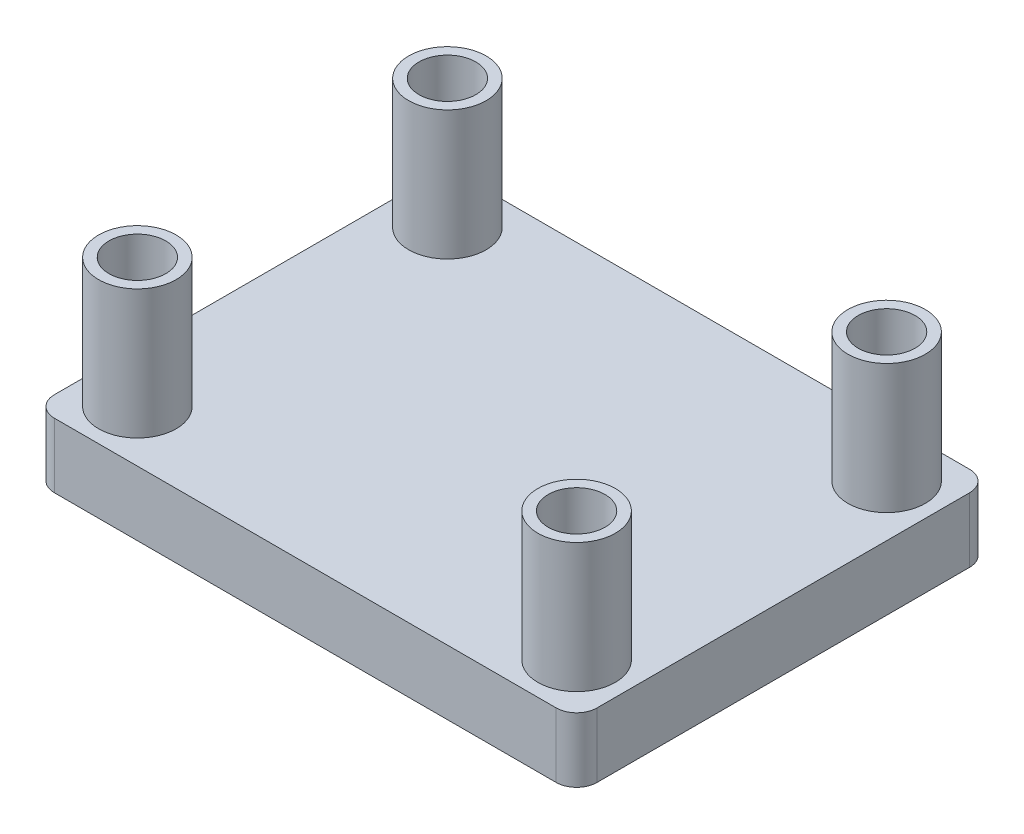
ISO-10303-21;
HEADER;
FILE_DESCRIPTION(('STEP AP214'),'2;1');
FILE_NAME('part.step','',(''),(''),'','','');
FILE_SCHEMA(('AUTOMOTIVE_DESIGN { 1 0 10303 214 1 1 1 1 }'));
ENDSEC;
DATA;
#1=APPLICATION_CONTEXT('core data for automotive mechanical design processes');
#2=APPLICATION_PROTOCOL_DEFINITION('international standard','automotive_design',2000,#1);
#3=PRODUCT_CONTEXT('',#1,'mechanical');
#4=PRODUCT('Part','Part','',(#3));
#5=PRODUCT_RELATED_PRODUCT_CATEGORY('part','',(#4));
#6=PRODUCT_DEFINITION_FORMATION('','',#4);
#7=PRODUCT_DEFINITION_CONTEXT('part definition',#1,'design');
#8=PRODUCT_DEFINITION('design','',#6,#7);
#9=PRODUCT_DEFINITION_SHAPE('','',#8);
#10=(LENGTH_UNIT() NAMED_UNIT(*) SI_UNIT(.MILLI.,.METRE.));
#11=(NAMED_UNIT(*) PLANE_ANGLE_UNIT() SI_UNIT($,.RADIAN.));
#12=(NAMED_UNIT(*) SI_UNIT($,.STERADIAN.) SOLID_ANGLE_UNIT());
#13=UNCERTAINTY_MEASURE_WITH_UNIT(LENGTH_MEASURE(1.E-05),#10,'distance_accuracy_value','');
#14=(GEOMETRIC_REPRESENTATION_CONTEXT(3) GLOBAL_UNCERTAINTY_ASSIGNED_CONTEXT((#13)) GLOBAL_UNIT_ASSIGNED_CONTEXT((#10,
#11,#12)) REPRESENTATION_CONTEXT('',''));
#15=CARTESIAN_POINT('',(0.,0.,0.));
#16=DIRECTION('',(0.,0.,1.));
#17=DIRECTION('',(1.,0.,0.));
#18=AXIS2_PLACEMENT_3D('',#15,#16,#17);
#19=CARTESIAN_POINT('',(-23.7863529411765,3.175,-11.5943529411765));
#20=DIRECTION('',(1.,0.,0.));
#21=DIRECTION('',(0.,0.,-1.));
#22=AXIS2_PLACEMENT_3D('',#19,#20,#21);
#23=PLANE('',#22);
#24=DIRECTION('',(0.,0.,1.));
#25=VECTOR('',#24,1.);
#26=CARTESIAN_POINT('',(-23.7863529411765,3.175,-11.5943529411765));
#27=LINE('',#26,#25);
#28=CARTESIAN_POINT('',(-23.7863529411765,3.175,-10.5943529411765));
#29=VERTEX_POINT('',#28);
#30=CARTESIAN_POINT('',(-23.7863529411765,3.175,7.72564705882353));
#31=VERTEX_POINT('',#30);
#32=EDGE_CURVE('E132',#29,#31,#27,.T.);
#33=ORIENTED_EDGE('',*,*,#32,.F.);
#34=DIRECTION('',(0.,-1.,0.));
#35=VECTOR('',#34,1.);
#36=CARTESIAN_POINT('',(-23.7863529411765,3.175,-10.5943529411765));
#37=LINE('',#36,#35);
#38=CARTESIAN_POINT('',(-23.7863529411765,0.,-10.5943529411765));
#39=VERTEX_POINT('',#38);
#40=EDGE_CURVE('E117',#29,#39,#37,.T.);
#41=ORIENTED_EDGE('',*,*,#40,.T.);
#42=DIRECTION('',(0.,0.,1.));
#43=VECTOR('',#42,1.);
#44=CARTESIAN_POINT('',(-23.7863529411765,0.,-11.5943529411765));
#45=LINE('',#44,#43);
#46=CARTESIAN_POINT('',(-23.7863529411765,0.,7.72564705882353));
#47=VERTEX_POINT('',#46);
#48=EDGE_CURVE('E129',#39,#47,#45,.T.);
#49=ORIENTED_EDGE('',*,*,#48,.T.);
#50=DIRECTION('',(0.,-1.,0.));
#51=VECTOR('',#50,1.);
#52=CARTESIAN_POINT('',(-23.7863529411765,3.175,7.72564705882353));
#53=LINE('',#52,#51);
#54=EDGE_CURVE('E134',#47,#31,#53,.F.);
#55=ORIENTED_EDGE('',*,*,#54,.T.);
#56=EDGE_LOOP('',(#33,#41,#49,#55));
#57=FACE_BOUND('',#56,.T.);
#58=ADVANCED_FACE('F48',(#57),#23,.F.);
#59=CARTESIAN_POINT('',(-23.7863529411765,3.175,8.72564705882353));
#60=DIRECTION('',(0.,0.,-1.));
#61=DIRECTION('',(-1.,0.,0.));
#62=AXIS2_PLACEMENT_3D('',#59,#60,#61);
#63=PLANE('',#62);
#64=DIRECTION('',(1.,0.,0.));
#65=VECTOR('',#64,1.);
#66=CARTESIAN_POINT('',(-23.7863529411765,3.175,8.72564705882353));
#67=LINE('',#66,#65);
#68=CARTESIAN_POINT('',(-22.7863529411765,3.175,8.72564705882353));
#69=VERTEX_POINT('',#68);
#70=CARTESIAN_POINT('',(1.88364705882353,3.175,8.72564705882353));
#71=VERTEX_POINT('',#70);
#72=EDGE_CURVE('E199',#69,#71,#67,.T.);
#73=ORIENTED_EDGE('',*,*,#72,.F.);
#74=DIRECTION('',(0.,-1.,0.));
#75=VECTOR('',#74,1.);
#76=CARTESIAN_POINT('',(-22.7863529411765,3.175,8.72564705882353));
#77=LINE('',#76,#75);
#78=CARTESIAN_POINT('',(-22.7863529411765,0.,8.72564705882353));
#79=VERTEX_POINT('',#78);
#80=EDGE_CURVE('E183',#69,#79,#77,.T.);
#81=ORIENTED_EDGE('',*,*,#80,.T.);
#82=DIRECTION('',(1.,0.,0.));
#83=VECTOR('',#82,1.);
#84=CARTESIAN_POINT('',(-23.7863529411765,0.,8.72564705882353));
#85=LINE('',#84,#83);
#86=CARTESIAN_POINT('',(1.88364705882353,0.,8.72564705882353));
#87=VERTEX_POINT('',#86);
#88=EDGE_CURVE('E138',#79,#87,#85,.T.);
#89=ORIENTED_EDGE('',*,*,#88,.T.);
#90=DIRECTION('',(0.,-1.,0.));
#91=VECTOR('',#90,1.);
#92=CARTESIAN_POINT('',(1.88364705882353,3.175,8.72564705882353));
#93=LINE('',#92,#91);
#94=EDGE_CURVE('E181',#87,#71,#93,.F.);
#95=ORIENTED_EDGE('',*,*,#94,.T.);
#96=EDGE_LOOP('',(#73,#81,#89,#95));
#97=FACE_BOUND('',#96,.T.);
#98=ADVANCED_FACE('F254',(#97),#63,.F.);
#99=CARTESIAN_POINT('',(2.88364705882353,3.175,-11.5943529411765));
#100=DIRECTION('',(-1.,0.,0.));
#101=DIRECTION('',(0.,0.,1.));
#102=AXIS2_PLACEMENT_3D('',#99,#100,#101);
#103=PLANE('',#102);
#104=DIRECTION('',(0.,0.,-1.));
#105=VECTOR('',#104,1.);
#106=CARTESIAN_POINT('',(2.88364705882353,0.,-11.5943529411765));
#107=LINE('',#106,#105);
#108=CARTESIAN_POINT('',(2.88364705882353,0.,7.72564705882353));
#109=VERTEX_POINT('',#108);
#110=CARTESIAN_POINT('',(2.88364705882353,0.,-10.5943529411765));
#111=VERTEX_POINT('',#110);
#112=EDGE_CURVE('E142',#109,#111,#107,.T.);
#113=ORIENTED_EDGE('',*,*,#112,.T.);
#114=DIRECTION('',(0.,-1.,0.));
#115=VECTOR('',#114,1.);
#116=CARTESIAN_POINT('',(2.88364705882353,3.175,-10.5943529411765));
#117=LINE('',#116,#115);
#118=CARTESIAN_POINT('',(2.88364705882353,3.175,-10.5943529411765));
#119=VERTEX_POINT('',#118);
#120=EDGE_CURVE('E12',#111,#119,#117,.F.);
#121=ORIENTED_EDGE('',*,*,#120,.T.);
#122=DIRECTION('',(0.,0.,-1.));
#123=VECTOR('',#122,1.);
#124=CARTESIAN_POINT('',(2.88364705882353,3.175,-11.5943529411765));
#125=LINE('',#124,#123);
#126=CARTESIAN_POINT('',(2.88364705882353,3.175,7.72564705882353));
#127=VERTEX_POINT('',#126);
#128=EDGE_CURVE('E189',#127,#119,#125,.T.);
#129=ORIENTED_EDGE('',*,*,#128,.F.);
#130=DIRECTION('',(0.,-1.,0.));
#131=VECTOR('',#130,1.);
#132=CARTESIAN_POINT('',(2.88364705882353,3.175,7.72564705882353));
#133=LINE('',#132,#131);
#134=EDGE_CURVE('E56',#127,#109,#133,.T.);
#135=ORIENTED_EDGE('',*,*,#134,.T.);
#136=EDGE_LOOP('',(#113,#121,#129,#135));
#137=FACE_BOUND('',#136,.T.);
#138=ADVANCED_FACE('F188',(#137),#103,.F.);
#139=CARTESIAN_POINT('',(-23.7863529411765,3.175,-11.5943529411765));
#140=DIRECTION('',(0.,0.,1.));
#141=DIRECTION('',(1.,0.,0.));
#142=AXIS2_PLACEMENT_3D('',#139,#140,#141);
#143=PLANE('',#142);
#144=DIRECTION('',(-1.,0.,0.));
#145=VECTOR('',#144,1.);
#146=CARTESIAN_POINT('',(-23.7863529411765,0.,-11.5943529411765));
#147=LINE('',#146,#145);
#148=CARTESIAN_POINT('',(1.88364705882352,0.,-11.5943529411765));
#149=VERTEX_POINT('',#148);
#150=CARTESIAN_POINT('',(-22.7863529411765,0.,-11.5943529411765));
#151=VERTEX_POINT('',#150);
#152=EDGE_CURVE('E152',#149,#151,#147,.T.);
#153=ORIENTED_EDGE('',*,*,#152,.T.);
#154=DIRECTION('',(0.,-1.,0.));
#155=VECTOR('',#154,1.);
#156=CARTESIAN_POINT('',(-22.7863529411765,3.175,-11.5943529411765));
#157=LINE('',#156,#155);
#158=CARTESIAN_POINT('',(-22.7863529411765,3.175,-11.5943529411765));
#159=VERTEX_POINT('',#158);
#160=EDGE_CURVE('E118',#151,#159,#157,.F.);
#161=ORIENTED_EDGE('',*,*,#160,.T.);
#162=DIRECTION('',(-1.,0.,0.));
#163=VECTOR('',#162,1.);
#164=CARTESIAN_POINT('',(-23.7863529411765,3.175,-11.5943529411765));
#165=LINE('',#164,#163);
#166=CARTESIAN_POINT('',(1.88364705882352,3.175,-11.5943529411765));
#167=VERTEX_POINT('',#166);
#168=EDGE_CURVE('E148',#167,#159,#165,.T.);
#169=ORIENTED_EDGE('',*,*,#168,.F.);
#170=DIRECTION('',(0.,-1.,0.));
#171=VECTOR('',#170,1.);
#172=CARTESIAN_POINT('',(1.88364705882352,3.175,-11.5943529411765));
#173=LINE('',#172,#171);
#174=EDGE_CURVE('E123',#167,#149,#173,.T.);
#175=ORIENTED_EDGE('',*,*,#174,.T.);
#176=EDGE_LOOP('',(#153,#161,#169,#175));
#177=FACE_BOUND('',#176,.T.);
#178=ADVANCED_FACE('F197',(#177),#143,.F.);
#179=CARTESIAN_POINT('',(0.,3.175,0.));
#180=DIRECTION('',(0.,1.,0.));
#181=DIRECTION('',(0.,0.,1.));
#182=AXIS2_PLACEMENT_3D('',#179,#180,#181);
#183=PLANE('',#182);
#184=CARTESIAN_POINT('',(0.343647058823518,3.175,6.18564705882353));
#185=DIRECTION('',(0.,1.,0.));
#186=DIRECTION('',(0.,0.,1.));
#187=AXIS2_PLACEMENT_3D('',#184,#185,#186);
#188=CIRCLE('',#187,1.905);
#189=CARTESIAN_POINT('',(0.343647058823518,3.175,8.09064705882353));
#190=VERTEX_POINT('',#189);
#191=EDGE_CURVE('E163',#190,#190,#188,.T.);
#192=ORIENTED_EDGE('',*,*,#191,.F.);
#193=EDGE_LOOP('',(#192));
#194=FACE_BOUND('',#193,.T.);
#195=CARTESIAN_POINT('',(-21.2463529411765,3.175,6.18564705882353));
#196=DIRECTION('',(0.,1.,0.));
#197=DIRECTION('',(0.,0.,1.));
#198=AXIS2_PLACEMENT_3D('',#195,#196,#197);
#199=CIRCLE('',#198,1.905);
#200=CARTESIAN_POINT('',(-21.2463529411765,3.175,8.09064705882353));
#201=VERTEX_POINT('',#200);
#202=EDGE_CURVE('E160',#201,#201,#199,.T.);
#203=ORIENTED_EDGE('',*,*,#202,.F.);
#204=EDGE_LOOP('',(#203));
#205=FACE_BOUND('',#204,.T.);
#206=CARTESIAN_POINT('',(0.343647058823532,3.175,-9.05435294117647));
#207=DIRECTION('',(0.,1.,0.));
#208=DIRECTION('',(0.,0.,1.));
#209=AXIS2_PLACEMENT_3D('',#206,#207,#208);
#210=CIRCLE('',#209,1.905);
#211=CARTESIAN_POINT('',(0.343647058823532,3.175,-7.14935294117647));
#212=VERTEX_POINT('',#211);
#213=EDGE_CURVE('E205',#212,#212,#210,.T.);
#214=ORIENTED_EDGE('',*,*,#213,.F.);
#215=EDGE_LOOP('',(#214));
#216=FACE_BOUND('',#215,.T.);
#217=CARTESIAN_POINT('',(-21.2463529411765,3.175,-9.05435294117647));
#218=DIRECTION('',(0.,1.,0.));
#219=DIRECTION('',(0.,0.,1.));
#220=AXIS2_PLACEMENT_3D('',#217,#218,#219);
#221=CIRCLE('',#220,1.905);
#222=CARTESIAN_POINT('',(-21.2463529411765,3.175,-7.14935294117647));
#223=VERTEX_POINT('',#222);
#224=EDGE_CURVE('E203',#223,#223,#221,.T.);
#225=ORIENTED_EDGE('',*,*,#224,.F.);
#226=EDGE_LOOP('',(#225));
#227=FACE_BOUND('',#226,.T.);
#228=ORIENTED_EDGE('',*,*,#168,.T.);
#229=CARTESIAN_POINT('',(-22.7863529411765,3.175,-10.5943529411765));
#230=DIRECTION('',(0.,1.,0.));
#231=DIRECTION('',(0.,0.,1.));
#232=AXIS2_PLACEMENT_3D('',#229,#230,#231);
#233=CIRCLE('',#232,1.);
#234=EDGE_CURVE('E179',#159,#29,#233,.T.);
#235=ORIENTED_EDGE('',*,*,#234,.T.);
#236=ORIENTED_EDGE('',*,*,#32,.T.);
#237=CARTESIAN_POINT('',(-22.7863529411765,3.175,7.72564705882353));
#238=DIRECTION('',(0.,1.,0.));
#239=DIRECTION('',(0.,0.,1.));
#240=AXIS2_PLACEMENT_3D('',#237,#238,#239);
#241=CIRCLE('',#240,1.);
#242=EDGE_CURVE('E177',#31,#69,#241,.T.);
#243=ORIENTED_EDGE('',*,*,#242,.T.);
#244=ORIENTED_EDGE('',*,*,#72,.T.);
#245=CARTESIAN_POINT('',(1.88364705882353,3.175,7.72564705882353));
#246=DIRECTION('',(0.,1.,0.));
#247=DIRECTION('',(0.,0.,1.));
#248=AXIS2_PLACEMENT_3D('',#245,#246,#247);
#249=CIRCLE('',#248,1.);
#250=EDGE_CURVE('E68',#71,#127,#249,.T.);
#251=ORIENTED_EDGE('',*,*,#250,.T.);
#252=ORIENTED_EDGE('',*,*,#128,.T.);
#253=CARTESIAN_POINT('',(1.88364705882352,3.175,-10.5943529411765));
#254=DIRECTION('',(0.,1.,0.));
#255=DIRECTION('',(0.,0.,1.));
#256=AXIS2_PLACEMENT_3D('',#253,#254,#255);
#257=CIRCLE('',#256,1.);
#258=EDGE_CURVE('E175',#119,#167,#257,.T.);
#259=ORIENTED_EDGE('',*,*,#258,.T.);
#260=EDGE_LOOP('',(#228,#235,#236,#243,#244,#251,#252,#259));
#261=FACE_BOUND('',#260,.T.);
#262=ADVANCED_FACE('F277',(#194,#205,#216,#227,#261),#183,.T.);
#263=CARTESIAN_POINT('',(0.,0.,0.));
#264=DIRECTION('',(0.,1.,0.));
#265=DIRECTION('',(0.,0.,1.));
#266=AXIS2_PLACEMENT_3D('',#263,#264,#265);
#267=PLANE('',#266);
#268=ORIENTED_EDGE('',*,*,#48,.F.);
#269=CARTESIAN_POINT('',(-22.7863529411765,0.,-10.5943529411765));
#270=DIRECTION('',(0.,1.,0.));
#271=DIRECTION('',(0.,0.,1.));
#272=AXIS2_PLACEMENT_3D('',#269,#270,#271);
#273=CIRCLE('',#272,1.);
#274=EDGE_CURVE('E113',#39,#151,#273,.F.);
#275=ORIENTED_EDGE('',*,*,#274,.T.);
#276=ORIENTED_EDGE('',*,*,#152,.F.);
#277=CARTESIAN_POINT('',(1.88364705882352,0.,-10.5943529411765));
#278=DIRECTION('',(0.,1.,0.));
#279=DIRECTION('',(0.,0.,1.));
#280=AXIS2_PLACEMENT_3D('',#277,#278,#279);
#281=CIRCLE('',#280,1.);
#282=EDGE_CURVE('E168',#149,#111,#281,.F.);
#283=ORIENTED_EDGE('',*,*,#282,.T.);
#284=ORIENTED_EDGE('',*,*,#112,.F.);
#285=CARTESIAN_POINT('',(1.88364705882353,0.,7.72564705882353));
#286=DIRECTION('',(0.,1.,0.));
#287=DIRECTION('',(0.,0.,1.));
#288=AXIS2_PLACEMENT_3D('',#285,#286,#287);
#289=CIRCLE('',#288,1.);
#290=EDGE_CURVE('E133',#109,#87,#289,.F.);
#291=ORIENTED_EDGE('',*,*,#290,.T.);
#292=ORIENTED_EDGE('',*,*,#88,.F.);
#293=CARTESIAN_POINT('',(-22.7863529411765,0.,7.72564705882353));
#294=DIRECTION('',(0.,1.,0.));
#295=DIRECTION('',(0.,0.,1.));
#296=AXIS2_PLACEMENT_3D('',#293,#294,#295);
#297=CIRCLE('',#296,1.);
#298=EDGE_CURVE('E124',#79,#47,#297,.F.);
#299=ORIENTED_EDGE('',*,*,#298,.T.);
#300=EDGE_LOOP('',(#268,#275,#276,#283,#284,#291,#292,#299));
#301=FACE_BOUND('',#300,.T.);
#302=ADVANCED_FACE('F136',(#301),#267,.F.);
#303=CARTESIAN_POINT('',(-21.2463529411765,9.525,-9.05435294117647));
#304=DIRECTION('',(0.,-1.,0.));
#305=DIRECTION('',(0.,0.,-1.));
#306=AXIS2_PLACEMENT_3D('',#303,#304,#305);
#307=CYLINDRICAL_SURFACE('',#306,1.397);
#308=CARTESIAN_POINT('',(-21.2463529411765,9.525,-9.05435294117647));
#309=DIRECTION('',(0.,1.,0.));
#310=DIRECTION('',(0.,0.,1.));
#311=AXIS2_PLACEMENT_3D('',#308,#309,#310);
#312=CIRCLE('',#311,1.397);
#313=CARTESIAN_POINT('',(-21.2463529411765,9.525,-7.65735294117648));
#314=VERTEX_POINT('',#313);
#315=EDGE_CURVE('E145',#314,#314,#312,.T.);
#316=ORIENTED_EDGE('',*,*,#315,.T.);
#317=EDGE_LOOP('',(#316));
#318=FACE_BOUND('',#317,.T.);
#319=CARTESIAN_POINT('',(-21.2463529411765,3.175,-9.05435294117647));
#320=DIRECTION('',(0.,1.,0.));
#321=DIRECTION('',(0.,0.,1.));
#322=AXIS2_PLACEMENT_3D('',#319,#320,#321);
#323=CIRCLE('',#322,1.397);
#324=CARTESIAN_POINT('',(-21.2463529411765,3.175,-7.65735294117648));
#325=VERTEX_POINT('',#324);
#326=EDGE_CURVE('E154',#325,#325,#323,.F.);
#327=ORIENTED_EDGE('',*,*,#326,.T.);
#328=EDGE_LOOP('',(#327));
#329=FACE_BOUND('',#328,.T.);
#330=ADVANCED_FACE('F287',(#318,#329),#307,.F.);
#331=CARTESIAN_POINT('',(-21.2463529411765,9.525,-9.05435294117647));
#332=DIRECTION('',(0.,-1.,0.));
#333=DIRECTION('',(0.,0.,-1.));
#334=AXIS2_PLACEMENT_3D('',#331,#332,#333);
#335=CYLINDRICAL_SURFACE('',#334,1.905);
#336=CARTESIAN_POINT('',(-21.2463529411765,9.525,-9.05435294117647));
#337=DIRECTION('',(0.,1.,0.));
#338=DIRECTION('',(0.,0.,1.));
#339=AXIS2_PLACEMENT_3D('',#336,#337,#338);
#340=CIRCLE('',#339,1.905);
#341=CARTESIAN_POINT('',(-21.2463529411765,9.525,-7.14935294117647));
#342=VERTEX_POINT('',#341);
#343=EDGE_CURVE('E139',#342,#342,#340,.T.);
#344=ORIENTED_EDGE('',*,*,#343,.F.);
#345=EDGE_LOOP('',(#344));
#346=FACE_BOUND('',#345,.T.);
#347=ORIENTED_EDGE('',*,*,#224,.T.);
#348=EDGE_LOOP('',(#347));
#349=FACE_BOUND('',#348,.T.);
#350=ADVANCED_FACE('F307',(#346,#349),#335,.T.);
#351=CARTESIAN_POINT('',(0.,9.525,0.));
#352=DIRECTION('',(0.,1.,0.));
#353=DIRECTION('',(0.,0.,1.));
#354=AXIS2_PLACEMENT_3D('',#351,#352,#353);
#355=PLANE('',#354);
#356=ORIENTED_EDGE('',*,*,#315,.F.);
#357=EDGE_LOOP('',(#356));
#358=FACE_BOUND('',#357,.T.);
#359=ORIENTED_EDGE('',*,*,#343,.T.);
#360=EDGE_LOOP('',(#359));
#361=FACE_BOUND('',#360,.T.);
#362=ADVANCED_FACE('F297',(#358,#361),#355,.T.);
#363=ORIENTED_EDGE('',*,*,#326,.F.);
#364=EDGE_LOOP('',(#363));
#365=FACE_BOUND('',#364,.T.);
#366=ADVANCED_FACE('F282',(#365),#183,.T.);
#367=CARTESIAN_POINT('',(0.343647058823532,9.525,-9.05435294117647));
#368=DIRECTION('',(0.,-1.,0.));
#369=DIRECTION('',(0.,0.,-1.));
#370=AXIS2_PLACEMENT_3D('',#367,#368,#369);
#371=CYLINDRICAL_SURFACE('',#370,1.397);
#372=CARTESIAN_POINT('',(0.343647058823532,9.525,-9.05435294117647));
#373=DIRECTION('',(0.,1.,0.));
#374=DIRECTION('',(0.,0.,1.));
#375=AXIS2_PLACEMENT_3D('',#372,#373,#374);
#376=CIRCLE('',#375,1.397);
#377=CARTESIAN_POINT('',(0.343647058823532,9.525,-7.65735294117647));
#378=VERTEX_POINT('',#377);
#379=EDGE_CURVE('E209',#378,#378,#376,.T.);
#380=ORIENTED_EDGE('',*,*,#379,.T.);
#381=EDGE_LOOP('',(#380));
#382=FACE_BOUND('',#381,.T.);
#383=CARTESIAN_POINT('',(0.343647058823532,3.175,-9.05435294117647));
#384=DIRECTION('',(0.,1.,0.));
#385=DIRECTION('',(0.,0.,1.));
#386=AXIS2_PLACEMENT_3D('',#383,#384,#385);
#387=CIRCLE('',#386,1.397);
#388=CARTESIAN_POINT('',(0.343647058823532,3.175,-7.65735294117647));
#389=VERTEX_POINT('',#388);
#390=EDGE_CURVE('E157',#389,#389,#387,.F.);
#391=ORIENTED_EDGE('',*,*,#390,.T.);
#392=EDGE_LOOP('',(#391));
#393=FACE_BOUND('',#392,.T.);
#394=ADVANCED_FACE('F296',(#382,#393),#371,.F.);
#395=CARTESIAN_POINT('',(0.343647058823532,9.525,-9.05435294117647));
#396=DIRECTION('',(0.,-1.,0.));
#397=DIRECTION('',(0.,0.,-1.));
#398=AXIS2_PLACEMENT_3D('',#395,#396,#397);
#399=CYLINDRICAL_SURFACE('',#398,1.905);
#400=CARTESIAN_POINT('',(0.343647058823532,9.525,-9.05435294117647));
#401=DIRECTION('',(0.,1.,0.));
#402=DIRECTION('',(0.,0.,1.));
#403=AXIS2_PLACEMENT_3D('',#400,#401,#402);
#404=CIRCLE('',#403,1.905);
#405=CARTESIAN_POINT('',(0.343647058823532,9.525,-7.14935294117647));
#406=VERTEX_POINT('',#405);
#407=EDGE_CURVE('E212',#406,#406,#404,.T.);
#408=ORIENTED_EDGE('',*,*,#407,.F.);
#409=EDGE_LOOP('',(#408));
#410=FACE_BOUND('',#409,.T.);
#411=ORIENTED_EDGE('',*,*,#213,.T.);
#412=EDGE_LOOP('',(#411));
#413=FACE_BOUND('',#412,.T.);
#414=ADVANCED_FACE('F304',(#410,#413),#399,.T.);
#415=CARTESIAN_POINT('',(0.,9.525,0.));
#416=DIRECTION('',(0.,1.,0.));
#417=DIRECTION('',(0.,0.,1.));
#418=AXIS2_PLACEMENT_3D('',#415,#416,#417);
#419=PLANE('',#418);
#420=ORIENTED_EDGE('',*,*,#379,.F.);
#421=EDGE_LOOP('',(#420));
#422=FACE_BOUND('',#421,.T.);
#423=ORIENTED_EDGE('',*,*,#407,.T.);
#424=EDGE_LOOP('',(#423));
#425=FACE_BOUND('',#424,.T.);
#426=ADVANCED_FACE('F313',(#422,#425),#419,.T.);
#427=ORIENTED_EDGE('',*,*,#390,.F.);
#428=EDGE_LOOP('',(#427));
#429=FACE_BOUND('',#428,.T.);
#430=ADVANCED_FACE('F299',(#429),#183,.T.);
#431=CARTESIAN_POINT('',(-21.2463529411765,9.525,6.18564705882353));
#432=DIRECTION('',(0.,-1.,0.));
#433=DIRECTION('',(0.,0.,-1.));
#434=AXIS2_PLACEMENT_3D('',#431,#432,#433);
#435=CYLINDRICAL_SURFACE('',#434,1.905);
#436=CARTESIAN_POINT('',(-21.2463529411765,9.525,6.18564705882353));
#437=DIRECTION('',(0.,-1.,0.));
#438=DIRECTION('',(0.,0.,-1.));
#439=AXIS2_PLACEMENT_3D('',#436,#437,#438);
#440=CIRCLE('',#439,1.905);
#441=CARTESIAN_POINT('',(-21.2463529411765,9.525,4.28064705882353));
#442=VERTEX_POINT('',#441);
#443=EDGE_CURVE('E221',#442,#442,#440,.T.);
#444=ORIENTED_EDGE('',*,*,#443,.T.);
#445=EDGE_LOOP('',(#444));
#446=FACE_BOUND('',#445,.T.);
#447=ORIENTED_EDGE('',*,*,#202,.T.);
#448=EDGE_LOOP('',(#447));
#449=FACE_BOUND('',#448,.T.);
#450=ADVANCED_FACE('F312',(#446,#449),#435,.T.);
#451=CARTESIAN_POINT('',(-21.2463529411765,9.525,6.18564705882353));
#452=DIRECTION('',(0.,-1.,0.));
#453=DIRECTION('',(0.,0.,-1.));
#454=AXIS2_PLACEMENT_3D('',#451,#452,#453);
#455=PLANE('',#454);
#456=CARTESIAN_POINT('',(-21.2463529411765,9.525,6.18564705882353));
#457=DIRECTION('',(0.,1.,0.));
#458=DIRECTION('',(0.,0.,1.));
#459=AXIS2_PLACEMENT_3D('',#456,#457,#458);
#460=CIRCLE('',#459,1.397);
#461=CARTESIAN_POINT('',(-21.2463529411765,9.525,7.58264705882353));
#462=VERTEX_POINT('',#461);
#463=EDGE_CURVE('E218',#462,#462,#460,.F.);
#464=ORIENTED_EDGE('',*,*,#463,.T.);
#465=EDGE_LOOP('',(#464));
#466=FACE_BOUND('',#465,.T.);
#467=ORIENTED_EDGE('',*,*,#443,.F.);
#468=EDGE_LOOP('',(#467));
#469=FACE_BOUND('',#468,.T.);
#470=ADVANCED_FACE('F319',(#466,#469),#455,.F.);
#471=CARTESIAN_POINT('',(-21.2463529411765,9.525,6.18564705882353));
#472=DIRECTION('',(0.,-1.,0.));
#473=DIRECTION('',(0.,0.,-1.));
#474=AXIS2_PLACEMENT_3D('',#471,#472,#473);
#475=CYLINDRICAL_SURFACE('',#474,1.397);
#476=ORIENTED_EDGE('',*,*,#463,.F.);
#477=EDGE_LOOP('',(#476));
#478=FACE_BOUND('',#477,.T.);
#479=CARTESIAN_POINT('',(-21.2463529411765,3.175,6.18564705882353));
#480=DIRECTION('',(0.,1.,0.));
#481=DIRECTION('',(0.,0.,1.));
#482=AXIS2_PLACEMENT_3D('',#479,#480,#481);
#483=CIRCLE('',#482,1.397);
#484=CARTESIAN_POINT('',(-21.2463529411765,3.175,7.58264705882353));
#485=VERTEX_POINT('',#484);
#486=EDGE_CURVE('E215',#485,#485,#483,.F.);
#487=ORIENTED_EDGE('',*,*,#486,.T.);
#488=EDGE_LOOP('',(#487));
#489=FACE_BOUND('',#488,.T.);
#490=ADVANCED_FACE('F326',(#478,#489),#475,.F.);
#491=ORIENTED_EDGE('',*,*,#486,.F.);
#492=EDGE_LOOP('',(#491));
#493=FACE_BOUND('',#492,.T.);
#494=ADVANCED_FACE('F251',(#493),#183,.T.);
#495=CARTESIAN_POINT('',(0.343647058823518,9.525,6.18564705882353));
#496=DIRECTION('',(0.,-1.,0.));
#497=DIRECTION('',(0.,0.,-1.));
#498=AXIS2_PLACEMENT_3D('',#495,#496,#497);
#499=CYLINDRICAL_SURFACE('',#498,1.905);
#500=CARTESIAN_POINT('',(0.343647058823518,9.525,6.18564705882353));
#501=DIRECTION('',(0.,-1.,0.));
#502=DIRECTION('',(0.,0.,-1.));
#503=AXIS2_PLACEMENT_3D('',#500,#501,#502);
#504=CIRCLE('',#503,1.905);
#505=CARTESIAN_POINT('',(0.343647058823518,9.525,4.28064705882353));
#506=VERTEX_POINT('',#505);
#507=EDGE_CURVE('E230',#506,#506,#504,.T.);
#508=ORIENTED_EDGE('',*,*,#507,.T.);
#509=EDGE_LOOP('',(#508));
#510=FACE_BOUND('',#509,.T.);
#511=ORIENTED_EDGE('',*,*,#191,.T.);
#512=EDGE_LOOP('',(#511));
#513=FACE_BOUND('',#512,.T.);
#514=ADVANCED_FACE('F236',(#510,#513),#499,.T.);
#515=CARTESIAN_POINT('',(0.343647058823518,9.525,6.18564705882353));
#516=DIRECTION('',(0.,-1.,0.));
#517=DIRECTION('',(0.,0.,-1.));
#518=AXIS2_PLACEMENT_3D('',#515,#516,#517);
#519=PLANE('',#518);
#520=CARTESIAN_POINT('',(0.343647058823518,9.525,6.18564705882353));
#521=DIRECTION('',(0.,1.,0.));
#522=DIRECTION('',(0.,0.,1.));
#523=AXIS2_PLACEMENT_3D('',#520,#521,#522);
#524=CIRCLE('',#523,1.397);
#525=CARTESIAN_POINT('',(0.343647058823518,9.525,7.58264705882353));
#526=VERTEX_POINT('',#525);
#527=EDGE_CURVE('E227',#526,#526,#524,.F.);
#528=ORIENTED_EDGE('',*,*,#527,.T.);
#529=EDGE_LOOP('',(#528));
#530=FACE_BOUND('',#529,.T.);
#531=ORIENTED_EDGE('',*,*,#507,.F.);
#532=EDGE_LOOP('',(#531));
#533=FACE_BOUND('',#532,.T.);
#534=ADVANCED_FACE('F239',(#530,#533),#519,.F.);
#535=CARTESIAN_POINT('',(0.343647058823518,9.525,6.18564705882353));
#536=DIRECTION('',(0.,-1.,0.));
#537=DIRECTION('',(0.,0.,-1.));
#538=AXIS2_PLACEMENT_3D('',#535,#536,#537);
#539=CYLINDRICAL_SURFACE('',#538,1.397);
#540=ORIENTED_EDGE('',*,*,#527,.F.);
#541=EDGE_LOOP('',(#540));
#542=FACE_BOUND('',#541,.T.);
#543=CARTESIAN_POINT('',(0.343647058823518,3.175,6.18564705882353));
#544=DIRECTION('',(0.,1.,0.));
#545=DIRECTION('',(0.,0.,1.));
#546=AXIS2_PLACEMENT_3D('',#543,#544,#545);
#547=CIRCLE('',#546,1.397);
#548=CARTESIAN_POINT('',(0.343647058823518,3.175,7.58264705882353));
#549=VERTEX_POINT('',#548);
#550=EDGE_CURVE('E226',#549,#549,#547,.F.);
#551=ORIENTED_EDGE('',*,*,#550,.T.);
#552=EDGE_LOOP('',(#551));
#553=FACE_BOUND('',#552,.T.);
#554=ADVANCED_FACE('F241',(#542,#553),#539,.F.);
#555=ORIENTED_EDGE('',*,*,#550,.F.);
#556=EDGE_LOOP('',(#555));
#557=FACE_BOUND('',#556,.T.);
#558=ADVANCED_FACE('F248',(#557),#183,.T.);
#559=CARTESIAN_POINT('',(-22.7863529411765,3.175,-10.5943529411765));
#560=DIRECTION('',(0.,-1.,0.));
#561=DIRECTION('',(0.,0.,-1.));
#562=AXIS2_PLACEMENT_3D('',#559,#560,#561);
#563=CYLINDRICAL_SURFACE('',#562,1.);
#564=ORIENTED_EDGE('',*,*,#234,.F.);
#565=ORIENTED_EDGE('',*,*,#160,.F.);
#566=ORIENTED_EDGE('',*,*,#274,.F.);
#567=ORIENTED_EDGE('',*,*,#40,.F.);
#568=EDGE_LOOP('',(#564,#565,#566,#567));
#569=FACE_BOUND('',#568,.T.);
#570=ADVANCED_FACE('F116',(#569),#563,.T.);
#571=CARTESIAN_POINT('',(-22.7863529411765,3.175,7.72564705882353));
#572=DIRECTION('',(0.,-1.,0.));
#573=DIRECTION('',(0.,0.,-1.));
#574=AXIS2_PLACEMENT_3D('',#571,#572,#573);
#575=CYLINDRICAL_SURFACE('',#574,1.);
#576=ORIENTED_EDGE('',*,*,#242,.F.);
#577=ORIENTED_EDGE('',*,*,#54,.F.);
#578=ORIENTED_EDGE('',*,*,#298,.F.);
#579=ORIENTED_EDGE('',*,*,#80,.F.);
#580=EDGE_LOOP('',(#576,#577,#578,#579));
#581=FACE_BOUND('',#580,.T.);
#582=ADVANCED_FACE('F265',(#581),#575,.T.);
#583=CARTESIAN_POINT('',(1.88364705882352,3.175,-10.5943529411765));
#584=DIRECTION('',(0.,-1.,0.));
#585=DIRECTION('',(0.,0.,-1.));
#586=AXIS2_PLACEMENT_3D('',#583,#584,#585);
#587=CYLINDRICAL_SURFACE('',#586,1.);
#588=ORIENTED_EDGE('',*,*,#258,.F.);
#589=ORIENTED_EDGE('',*,*,#120,.F.);
#590=ORIENTED_EDGE('',*,*,#282,.F.);
#591=ORIENTED_EDGE('',*,*,#174,.F.);
#592=EDGE_LOOP('',(#588,#589,#590,#591));
#593=FACE_BOUND('',#592,.T.);
#594=ADVANCED_FACE('F194',(#593),#587,.T.);
#595=CARTESIAN_POINT('',(1.88364705882353,3.175,7.72564705882353));
#596=DIRECTION('',(0.,-1.,0.));
#597=DIRECTION('',(0.,0.,-1.));
#598=AXIS2_PLACEMENT_3D('',#595,#596,#597);
#599=CYLINDRICAL_SURFACE('',#598,1.);
#600=ORIENTED_EDGE('',*,*,#250,.F.);
#601=ORIENTED_EDGE('',*,*,#94,.F.);
#602=ORIENTED_EDGE('',*,*,#290,.F.);
#603=ORIENTED_EDGE('',*,*,#134,.F.);
#604=EDGE_LOOP('',(#600,#601,#602,#603));
#605=FACE_BOUND('',#604,.T.);
#606=ADVANCED_FACE('F50',(#605),#599,.T.);
#607=CLOSED_SHELL('',(#58,#98,#138,#178,#262,#302,#330,#350,#362,#366,#394,#414,#426,#430,#450,
#470,#490,#494,#514,#534,#554,#558,#570,#582,#594,#606));
#608=MANIFOLD_SOLID_BREP('B2',#607);
#609=ADVANCED_BREP_SHAPE_REPRESENTATION('',(#18,#608),#14);
#610=SHAPE_DEFINITION_REPRESENTATION(#9,#609);
ENDSEC;
END-ISO-10303-21;
